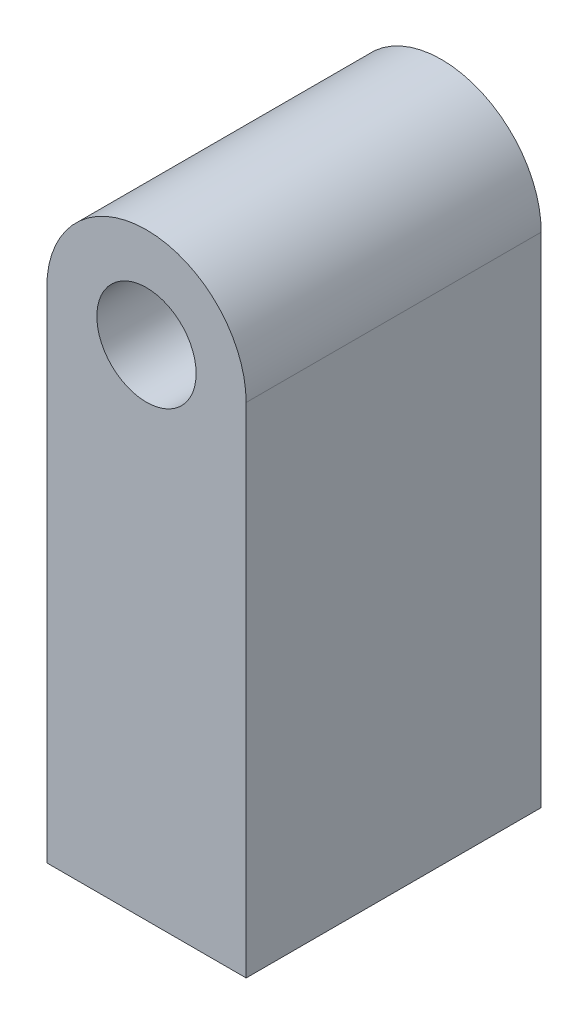
ISO-10303-21;
HEADER;
FILE_DESCRIPTION(('STEP AP214'),'2;1');
FILE_NAME('part.step','',(''),(''),'','','');
FILE_SCHEMA(('AUTOMOTIVE_DESIGN { 1 0 10303 214 1 1 1 1 }'));
ENDSEC;
DATA;
#1=APPLICATION_CONTEXT('core data for automotive mechanical design processes');
#2=APPLICATION_PROTOCOL_DEFINITION('international standard','automotive_design',2000,#1);
#3=PRODUCT_CONTEXT('',#1,'mechanical');
#4=PRODUCT('Part','Part','',(#3));
#5=PRODUCT_RELATED_PRODUCT_CATEGORY('part','',(#4));
#6=PRODUCT_DEFINITION_FORMATION('','',#4);
#7=PRODUCT_DEFINITION_CONTEXT('part definition',#1,'design');
#8=PRODUCT_DEFINITION('design','',#6,#7);
#9=PRODUCT_DEFINITION_SHAPE('','',#8);
#10=(LENGTH_UNIT() NAMED_UNIT(*) SI_UNIT(.MILLI.,.METRE.));
#11=(NAMED_UNIT(*) PLANE_ANGLE_UNIT() SI_UNIT($,.RADIAN.));
#12=(NAMED_UNIT(*) SI_UNIT($,.STERADIAN.) SOLID_ANGLE_UNIT());
#13=UNCERTAINTY_MEASURE_WITH_UNIT(LENGTH_MEASURE(1.E-05),#10,'distance_accuracy_value','');
#14=(GEOMETRIC_REPRESENTATION_CONTEXT(3) GLOBAL_UNCERTAINTY_ASSIGNED_CONTEXT((#13)) GLOBAL_UNIT_ASSIGNED_CONTEXT((#10,
#11,#12)) REPRESENTATION_CONTEXT('',''));
#15=CARTESIAN_POINT('',(0.,0.,0.));
#16=DIRECTION('',(0.,0.,1.));
#17=DIRECTION('',(1.,0.,0.));
#18=AXIS2_PLACEMENT_3D('',#15,#16,#17);
#19=CARTESIAN_POINT('',(-6.34999999999999,0.,9.398));
#20=DIRECTION('',(1.,0.,0.));
#21=DIRECTION('',(0.,0.,-1.));
#22=AXIS2_PLACEMENT_3D('',#19,#20,#21);
#23=PLANE('',#22);
#24=DIRECTION('',(0.,-1.,0.));
#25=VECTOR('',#24,1.);
#26=CARTESIAN_POINT('',(-6.34999999999999,0.,-9.398));
#27=LINE('',#26,#25);
#28=CARTESIAN_POINT('',(-6.34999999999999,31.75,-9.398));
#29=VERTEX_POINT('',#28);
#30=CARTESIAN_POINT('',(-6.34999999999999,0.,-9.398));
#31=VERTEX_POINT('',#30);
#32=EDGE_CURVE('E142',#29,#31,#27,.T.);
#33=ORIENTED_EDGE('',*,*,#32,.T.);
#34=DIRECTION('',(0.,0.,-1.));
#35=VECTOR('',#34,1.);
#36=CARTESIAN_POINT('',(-6.34999999999999,0.,9.398));
#37=LINE('',#36,#35);
#38=CARTESIAN_POINT('',(-6.34999999999999,0.,9.398));
#39=VERTEX_POINT('',#38);
#40=EDGE_CURVE('E11',#39,#31,#37,.T.);
#41=ORIENTED_EDGE('',*,*,#40,.F.);
#42=DIRECTION('',(0.,-1.,0.));
#43=VECTOR('',#42,1.);
#44=CARTESIAN_POINT('',(-6.34999999999999,0.,9.398));
#45=LINE('',#44,#43);
#46=CARTESIAN_POINT('',(-6.34999999999999,31.75,9.398));
#47=VERTEX_POINT('',#46);
#48=EDGE_CURVE('E143',#47,#39,#45,.T.);
#49=ORIENTED_EDGE('',*,*,#48,.F.);
#50=DIRECTION('',(0.,0.,-1.));
#51=VECTOR('',#50,1.);
#52=CARTESIAN_POINT('',(-6.34999999999999,31.75,9.398));
#53=LINE('',#52,#51);
#54=EDGE_CURVE('E153',#47,#29,#53,.T.);
#55=ORIENTED_EDGE('',*,*,#54,.T.);
#56=EDGE_LOOP('',(#33,#41,#49,#55));
#57=FACE_BOUND('',#56,.T.);
#58=ADVANCED_FACE('F55',(#57),#23,.F.);
#59=CARTESIAN_POINT('',(-6.34999999999999,0.,9.398));
#60=DIRECTION('',(0.,1.,0.));
#61=DIRECTION('',(-1.,0.,0.));
#62=AXIS2_PLACEMENT_3D('',#59,#60,#61);
#63=PLANE('',#62);
#64=CARTESIAN_POINT('',(0.,0.,0.));
#65=DIRECTION('',(0.,-1.,0.));
#66=DIRECTION('',(0.,0.,-1.));
#67=AXIS2_PLACEMENT_3D('',#64,#65,#66);
#68=CIRCLE('',#67,2.55269999999999);
#69=CARTESIAN_POINT('',(0.,0.,-2.55269999999999));
#70=VERTEX_POINT('',#69);
#71=EDGE_CURVE('E128',#70,#70,#68,.T.);
#72=ORIENTED_EDGE('',*,*,#71,.F.);
#73=EDGE_LOOP('',(#72));
#74=FACE_BOUND('',#73,.T.);
#75=DIRECTION('',(1.,0.,0.));
#76=VECTOR('',#75,1.);
#77=CARTESIAN_POINT('',(-6.34999999999999,0.,-9.398));
#78=LINE('',#77,#76);
#79=CARTESIAN_POINT('',(6.35000000000001,0.,-9.398));
#80=VERTEX_POINT('',#79);
#81=EDGE_CURVE('E157',#31,#80,#78,.T.);
#82=ORIENTED_EDGE('',*,*,#81,.T.);
#83=DIRECTION('',(0.,0.,-1.));
#84=VECTOR('',#83,1.);
#85=CARTESIAN_POINT('',(6.35000000000001,0.,9.398));
#86=LINE('',#85,#84);
#87=CARTESIAN_POINT('',(6.35000000000001,0.,9.398));
#88=VERTEX_POINT('',#87);
#89=EDGE_CURVE('E64',#88,#80,#86,.T.);
#90=ORIENTED_EDGE('',*,*,#89,.F.);
#91=DIRECTION('',(1.,0.,0.));
#92=VECTOR('',#91,1.);
#93=CARTESIAN_POINT('',(-6.34999999999999,0.,9.398));
#94=LINE('',#93,#92);
#95=EDGE_CURVE('E111',#39,#88,#94,.T.);
#96=ORIENTED_EDGE('',*,*,#95,.F.);
#97=ORIENTED_EDGE('',*,*,#40,.T.);
#98=EDGE_LOOP('',(#82,#90,#96,#97));
#99=FACE_BOUND('',#98,.T.);
#100=ADVANCED_FACE('F187',(#74,#99),#63,.F.);
#101=CARTESIAN_POINT('',(6.35000000000001,0.,9.398));
#102=DIRECTION('',(-1.,0.,0.));
#103=DIRECTION('',(0.,-1.,0.));
#104=AXIS2_PLACEMENT_3D('',#101,#102,#103);
#105=PLANE('',#104);
#106=DIRECTION('',(0.,1.,0.));
#107=VECTOR('',#106,1.);
#108=CARTESIAN_POINT('',(6.35000000000001,0.,-9.398));
#109=LINE('',#108,#107);
#110=CARTESIAN_POINT('',(6.34999999999999,31.75,-9.398));
#111=VERTEX_POINT('',#110);
#112=EDGE_CURVE('E96',#80,#111,#109,.T.);
#113=ORIENTED_EDGE('',*,*,#112,.T.);
#114=DIRECTION('',(0.,0.,-1.));
#115=VECTOR('',#114,1.);
#116=CARTESIAN_POINT('',(6.34999999999999,31.75,9.398));
#117=LINE('',#116,#115);
#118=CARTESIAN_POINT('',(6.34999999999999,31.75,9.398));
#119=VERTEX_POINT('',#118);
#120=EDGE_CURVE('E165',#119,#111,#117,.T.);
#121=ORIENTED_EDGE('',*,*,#120,.F.);
#122=DIRECTION('',(0.,1.,0.));
#123=VECTOR('',#122,1.);
#124=CARTESIAN_POINT('',(6.35000000000001,0.,9.398));
#125=LINE('',#124,#123);
#126=EDGE_CURVE('E148',#88,#119,#125,.T.);
#127=ORIENTED_EDGE('',*,*,#126,.F.);
#128=ORIENTED_EDGE('',*,*,#89,.T.);
#129=EDGE_LOOP('',(#113,#121,#127,#128));
#130=FACE_BOUND('',#129,.T.);
#131=ADVANCED_FACE('F169',(#130),#105,.F.);
#132=CARTESIAN_POINT('',(0.,31.75,9.398));
#133=DIRECTION('',(0.,0.,-1.));
#134=DIRECTION('',(-1.,0.,0.));
#135=AXIS2_PLACEMENT_3D('',#132,#133,#134);
#136=CYLINDRICAL_SURFACE('',#135,6.34999999999999);
#137=CARTESIAN_POINT('',(0.,31.75,-9.398));
#138=DIRECTION('',(0.,0.,1.));
#139=DIRECTION('',(-1.,0.,0.));
#140=AXIS2_PLACEMENT_3D('',#137,#138,#139);
#141=CIRCLE('',#140,6.34999999999999);
#142=EDGE_CURVE('E102',#111,#29,#141,.T.);
#143=ORIENTED_EDGE('',*,*,#142,.T.);
#144=ORIENTED_EDGE('',*,*,#54,.F.);
#145=CARTESIAN_POINT('',(0.,31.75,9.398));
#146=DIRECTION('',(0.,0.,1.));
#147=DIRECTION('',(-1.,0.,0.));
#148=AXIS2_PLACEMENT_3D('',#145,#146,#147);
#149=CIRCLE('',#148,6.34999999999999);
#150=EDGE_CURVE('E75',#119,#47,#149,.T.);
#151=ORIENTED_EDGE('',*,*,#150,.F.);
#152=ORIENTED_EDGE('',*,*,#120,.T.);
#153=EDGE_LOOP('',(#143,#144,#151,#152));
#154=FACE_BOUND('',#153,.T.);
#155=ADVANCED_FACE('F176',(#154),#136,.T.);
#156=CARTESIAN_POINT('',(0.,31.75,9.398));
#157=DIRECTION('',(0.,0.,-1.));
#158=DIRECTION('',(-1.,0.,0.));
#159=AXIS2_PLACEMENT_3D('',#156,#157,#158);
#160=PLANE('',#159);
#161=CARTESIAN_POINT('',(0.,31.75,9.398));
#162=DIRECTION('',(0.,0.,1.));
#163=DIRECTION('',(1.,0.,0.));
#164=AXIS2_PLACEMENT_3D('',#161,#162,#163);
#165=CIRCLE('',#164,3.1623);
#166=CARTESIAN_POINT('',(3.1623,31.75,9.398));
#167=VERTEX_POINT('',#166);
#168=EDGE_CURVE('E127',#167,#167,#165,.T.);
#169=ORIENTED_EDGE('',*,*,#168,.F.);
#170=EDGE_LOOP('',(#169));
#171=FACE_BOUND('',#170,.T.);
#172=ORIENTED_EDGE('',*,*,#48,.T.);
#173=ORIENTED_EDGE('',*,*,#95,.T.);
#174=ORIENTED_EDGE('',*,*,#126,.T.);
#175=ORIENTED_EDGE('',*,*,#150,.T.);
#176=EDGE_LOOP('',(#172,#173,#174,#175));
#177=FACE_BOUND('',#176,.T.);
#178=ADVANCED_FACE('F178',(#171,#177),#160,.F.);
#179=CARTESIAN_POINT('',(0.,31.75,-9.398));
#180=DIRECTION('',(0.,0.,-1.));
#181=DIRECTION('',(-1.,0.,0.));
#182=AXIS2_PLACEMENT_3D('',#179,#180,#181);
#183=PLANE('',#182);
#184=CARTESIAN_POINT('',(0.,31.75,-9.398));
#185=DIRECTION('',(0.,0.,1.));
#186=DIRECTION('',(1.,0.,0.));
#187=AXIS2_PLACEMENT_3D('',#184,#185,#186);
#188=CIRCLE('',#187,3.1623);
#189=CARTESIAN_POINT('',(3.1623,31.75,-9.398));
#190=VERTEX_POINT('',#189);
#191=EDGE_CURVE('E134',#190,#190,#188,.T.);
#192=ORIENTED_EDGE('',*,*,#191,.T.);
#193=EDGE_LOOP('',(#192));
#194=FACE_BOUND('',#193,.T.);
#195=ORIENTED_EDGE('',*,*,#32,.F.);
#196=ORIENTED_EDGE('',*,*,#142,.F.);
#197=ORIENTED_EDGE('',*,*,#112,.F.);
#198=ORIENTED_EDGE('',*,*,#81,.F.);
#199=EDGE_LOOP('',(#195,#196,#197,#198));
#200=FACE_BOUND('',#199,.T.);
#201=ADVANCED_FACE('F172',(#194,#200),#183,.T.);
#202=CARTESIAN_POINT('',(0.,31.75,9.398));
#203=DIRECTION('',(0.,0.,1.));
#204=DIRECTION('',(1.,0.,0.));
#205=AXIS2_PLACEMENT_3D('',#202,#203,#204);
#206=CYLINDRICAL_SURFACE('',#205,3.1623);
#207=ORIENTED_EDGE('',*,*,#191,.F.);
#208=EDGE_LOOP('',(#207));
#209=FACE_BOUND('',#208,.T.);
#210=ORIENTED_EDGE('',*,*,#168,.T.);
#211=EDGE_LOOP('',(#210));
#212=FACE_BOUND('',#211,.T.);
#213=ADVANCED_FACE('F120',(#209,#212),#206,.F.);
#214=CARTESIAN_POINT('',(0.,13.335,0.));
#215=DIRECTION('',(0.,-1.,0.));
#216=DIRECTION('',(0.,0.,-1.));
#217=AXIS2_PLACEMENT_3D('',#214,#215,#216);
#218=CONICAL_SURFACE('',#217,2.5527,1.02974425867665);
#219=CARTESIAN_POINT('',(0.,14.8688169021917,0.));
#220=VERTEX_POINT('',#219);
#221=VERTEX_LOOP('',#220);
#222=FACE_BOUND('',#221,.T.);
#223=CARTESIAN_POINT('',(0.,13.335,0.));
#224=DIRECTION('',(0.,-1.,0.));
#225=DIRECTION('',(0.,0.,-1.));
#226=AXIS2_PLACEMENT_3D('',#223,#224,#225);
#227=CIRCLE('',#226,2.5527);
#228=CARTESIAN_POINT('',(0.,13.335,-2.5527));
#229=VERTEX_POINT('',#228);
#230=EDGE_CURVE('E124',#229,#229,#227,.T.);
#231=ORIENTED_EDGE('',*,*,#230,.T.);
#232=EDGE_LOOP('',(#231));
#233=FACE_BOUND('',#232,.T.);
#234=ADVANCED_FACE('F116',(#222,#233),#218,.F.);
#235=CARTESIAN_POINT('',(0.,0.,0.));
#236=DIRECTION('',(0.,-1.,0.));
#237=DIRECTION('',(0.,0.,-1.));
#238=AXIS2_PLACEMENT_3D('',#235,#236,#237);
#239=CYLINDRICAL_SURFACE('',#238,2.55269999999999);
#240=ORIENTED_EDGE('',*,*,#230,.F.);
#241=EDGE_LOOP('',(#240));
#242=FACE_BOUND('',#241,.T.);
#243=ORIENTED_EDGE('',*,*,#71,.T.);
#244=EDGE_LOOP('',(#243));
#245=FACE_BOUND('',#244,.T.);
#246=ADVANCED_FACE('F119',(#242,#245),#239,.F.);
#247=CLOSED_SHELL('',(#58,#100,#131,#155,#178,#201,#213,#234,#246));
#248=MANIFOLD_SOLID_BREP('B2',#247);
#249=ADVANCED_BREP_SHAPE_REPRESENTATION('',(#18,#248),#14);
#250=SHAPE_DEFINITION_REPRESENTATION(#9,#249);
ENDSEC;
END-ISO-10303-21;
